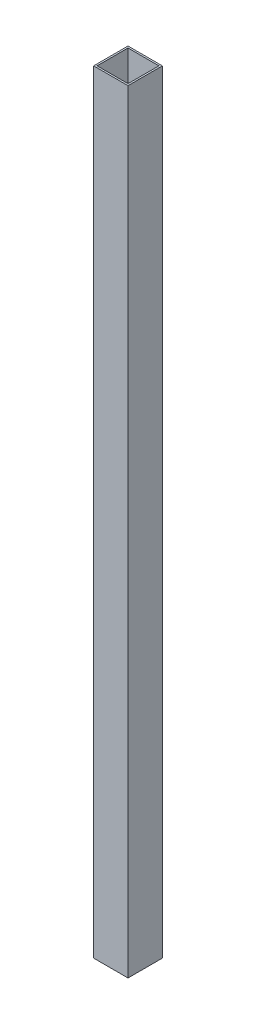
ISO-10303-21;
HEADER;
FILE_DESCRIPTION(('STEP AP214'),'2;1');
FILE_NAME('part.step','',(''),(''),'','','');
FILE_SCHEMA(('AUTOMOTIVE_DESIGN { 1 0 10303 214 1 1 1 1 }'));
ENDSEC;
DATA;
#1=APPLICATION_CONTEXT('core data for automotive mechanical design processes');
#2=APPLICATION_PROTOCOL_DEFINITION('international standard','automotive_design',2000,#1);
#3=PRODUCT_CONTEXT('',#1,'mechanical');
#4=PRODUCT('Part','Part','',(#3));
#5=PRODUCT_RELATED_PRODUCT_CATEGORY('part','',(#4));
#6=PRODUCT_DEFINITION_FORMATION('','',#4);
#7=PRODUCT_DEFINITION_CONTEXT('part definition',#1,'design');
#8=PRODUCT_DEFINITION('design','',#6,#7);
#9=PRODUCT_DEFINITION_SHAPE('','',#8);
#10=(LENGTH_UNIT() NAMED_UNIT(*) SI_UNIT(.MILLI.,.METRE.));
#11=(NAMED_UNIT(*) PLANE_ANGLE_UNIT() SI_UNIT($,.RADIAN.));
#12=(NAMED_UNIT(*) SI_UNIT($,.STERADIAN.) SOLID_ANGLE_UNIT());
#13=UNCERTAINTY_MEASURE_WITH_UNIT(LENGTH_MEASURE(1.E-05),#10,'distance_accuracy_value','');
#14=(GEOMETRIC_REPRESENTATION_CONTEXT(3) GLOBAL_UNCERTAINTY_ASSIGNED_CONTEXT((#13)) GLOBAL_UNIT_ASSIGNED_CONTEXT((#10,
#11,#12)) REPRESENTATION_CONTEXT('',''));
#15=CARTESIAN_POINT('',(0.,0.,0.));
#16=DIRECTION('',(0.,0.,1.));
#17=DIRECTION('',(1.,0.,0.));
#18=AXIS2_PLACEMENT_3D('',#15,#16,#17);
#19=CARTESIAN_POINT('',(20.,900.,20.));
#20=DIRECTION('',(-1.,0.,0.));
#21=DIRECTION('',(0.,0.,1.));
#22=AXIS2_PLACEMENT_3D('',#19,#20,#21);
#23=PLANE('',#22);
#24=DIRECTION('',(0.,0.,-1.));
#25=VECTOR('',#24,1.);
#26=CARTESIAN_POINT('',(20.,0.,20.));
#27=LINE('',#26,#25);
#28=CARTESIAN_POINT('',(20.,0.,20.));
#29=VERTEX_POINT('',#28);
#30=CARTESIAN_POINT('',(20.,0.,-20.));
#31=VERTEX_POINT('',#30);
#32=EDGE_CURVE('E129',#29,#31,#27,.T.);
#33=ORIENTED_EDGE('',*,*,#32,.T.);
#34=DIRECTION('',(0.,-1.,0.));
#35=VECTOR('',#34,1.);
#36=CARTESIAN_POINT('',(20.,900.,-20.));
#37=LINE('',#36,#35);
#38=CARTESIAN_POINT('',(20.,900.,-20.));
#39=VERTEX_POINT('',#38);
#40=EDGE_CURVE('E11',#39,#31,#37,.T.);
#41=ORIENTED_EDGE('',*,*,#40,.F.);
#42=DIRECTION('',(0.,0.,-1.));
#43=VECTOR('',#42,1.);
#44=CARTESIAN_POINT('',(20.,900.,20.));
#45=LINE('',#44,#43);
#46=CARTESIAN_POINT('',(20.,900.,20.));
#47=VERTEX_POINT('',#46);
#48=EDGE_CURVE('E133',#47,#39,#45,.T.);
#49=ORIENTED_EDGE('',*,*,#48,.F.);
#50=DIRECTION('',(0.,-1.,0.));
#51=VECTOR('',#50,1.);
#52=CARTESIAN_POINT('',(20.,900.,20.));
#53=LINE('',#52,#51);
#54=EDGE_CURVE('E143',#47,#29,#53,.T.);
#55=ORIENTED_EDGE('',*,*,#54,.T.);
#56=EDGE_LOOP('',(#33,#41,#49,#55));
#57=FACE_BOUND('',#56,.T.);
#58=ADVANCED_FACE('F32',(#57),#23,.F.);
#59=CARTESIAN_POINT('',(-20.,900.,-20.));
#60=DIRECTION('',(0.,0.,1.));
#61=DIRECTION('',(1.,0.,0.));
#62=AXIS2_PLACEMENT_3D('',#59,#60,#61);
#63=PLANE('',#62);
#64=DIRECTION('',(-1.,0.,0.));
#65=VECTOR('',#64,1.);
#66=CARTESIAN_POINT('',(-20.,0.,-20.));
#67=LINE('',#66,#65);
#68=CARTESIAN_POINT('',(-20.,0.,-20.));
#69=VERTEX_POINT('',#68);
#70=EDGE_CURVE('E146',#31,#69,#67,.T.);
#71=ORIENTED_EDGE('',*,*,#70,.T.);
#72=DIRECTION('',(0.,-1.,0.));
#73=VECTOR('',#72,1.);
#74=CARTESIAN_POINT('',(-20.,900.,-20.));
#75=LINE('',#74,#73);
#76=CARTESIAN_POINT('',(-20.,900.,-20.));
#77=VERTEX_POINT('',#76);
#78=EDGE_CURVE('E39',#77,#69,#75,.T.);
#79=ORIENTED_EDGE('',*,*,#78,.F.);
#80=DIRECTION('',(-1.,0.,0.));
#81=VECTOR('',#80,1.);
#82=CARTESIAN_POINT('',(-20.,900.,-20.));
#83=LINE('',#82,#81);
#84=EDGE_CURVE('E136',#39,#77,#83,.T.);
#85=ORIENTED_EDGE('',*,*,#84,.F.);
#86=ORIENTED_EDGE('',*,*,#40,.T.);
#87=EDGE_LOOP('',(#71,#79,#85,#86));
#88=FACE_BOUND('',#87,.T.);
#89=ADVANCED_FACE('F174',(#88),#63,.F.);
#90=CARTESIAN_POINT('',(-20.,900.,20.));
#91=DIRECTION('',(1.,0.,0.));
#92=DIRECTION('',(0.,0.,-1.));
#93=AXIS2_PLACEMENT_3D('',#90,#91,#92);
#94=PLANE('',#93);
#95=DIRECTION('',(0.,0.,1.));
#96=VECTOR('',#95,1.);
#97=CARTESIAN_POINT('',(-20.,0.,20.));
#98=LINE('',#97,#96);
#99=CARTESIAN_POINT('',(-20.,0.,20.));
#100=VERTEX_POINT('',#99);
#101=EDGE_CURVE('E148',#69,#100,#98,.T.);
#102=ORIENTED_EDGE('',*,*,#101,.T.);
#103=DIRECTION('',(0.,-1.,0.));
#104=VECTOR('',#103,1.);
#105=CARTESIAN_POINT('',(-20.,900.,20.));
#106=LINE('',#105,#104);
#107=CARTESIAN_POINT('',(-20.,900.,20.));
#108=VERTEX_POINT('',#107);
#109=EDGE_CURVE('E153',#108,#100,#106,.T.);
#110=ORIENTED_EDGE('',*,*,#109,.F.);
#111=DIRECTION('',(0.,0.,1.));
#112=VECTOR('',#111,1.);
#113=CARTESIAN_POINT('',(-20.,900.,20.));
#114=LINE('',#113,#112);
#115=EDGE_CURVE('E139',#77,#108,#114,.T.);
#116=ORIENTED_EDGE('',*,*,#115,.F.);
#117=ORIENTED_EDGE('',*,*,#78,.T.);
#118=EDGE_LOOP('',(#102,#110,#116,#117));
#119=FACE_BOUND('',#118,.T.);
#120=ADVANCED_FACE('F160',(#119),#94,.F.);
#121=CARTESIAN_POINT('',(-20.,900.,20.));
#122=DIRECTION('',(0.,0.,-1.));
#123=DIRECTION('',(-1.,0.,0.));
#124=AXIS2_PLACEMENT_3D('',#121,#122,#123);
#125=PLANE('',#124);
#126=DIRECTION('',(1.,0.,0.));
#127=VECTOR('',#126,1.);
#128=CARTESIAN_POINT('',(-20.,0.,20.));
#129=LINE('',#128,#127);
#130=EDGE_CURVE('E137',#100,#29,#129,.T.);
#131=ORIENTED_EDGE('',*,*,#130,.T.);
#132=ORIENTED_EDGE('',*,*,#54,.F.);
#133=DIRECTION('',(1.,0.,0.));
#134=VECTOR('',#133,1.);
#135=CARTESIAN_POINT('',(-20.,900.,20.));
#136=LINE('',#135,#134);
#137=EDGE_CURVE('E141',#108,#47,#136,.T.);
#138=ORIENTED_EDGE('',*,*,#137,.F.);
#139=ORIENTED_EDGE('',*,*,#109,.T.);
#140=EDGE_LOOP('',(#131,#132,#138,#139));
#141=FACE_BOUND('',#140,.T.);
#142=ADVANCED_FACE('F167',(#141),#125,.F.);
#143=CARTESIAN_POINT('',(0.,900.,0.));
#144=DIRECTION('',(0.,-1.,0.));
#145=DIRECTION('',(0.,0.,-1.));
#146=AXIS2_PLACEMENT_3D('',#143,#144,#145);
#147=PLANE('',#146);
#148=DIRECTION('',(0.,0.,-1.));
#149=VECTOR('',#148,1.);
#150=CARTESIAN_POINT('',(18.,900.,18.));
#151=LINE('',#150,#149);
#152=CARTESIAN_POINT('',(18.,900.,18.));
#153=VERTEX_POINT('',#152);
#154=CARTESIAN_POINT('',(18.,900.,-18.));
#155=VERTEX_POINT('',#154);
#156=EDGE_CURVE('E123',#153,#155,#151,.T.);
#157=ORIENTED_EDGE('',*,*,#156,.F.);
#158=DIRECTION('',(1.,0.,0.));
#159=VECTOR('',#158,1.);
#160=CARTESIAN_POINT('',(-18.,900.,18.));
#161=LINE('',#160,#159);
#162=CARTESIAN_POINT('',(-18.,900.,18.));
#163=VERTEX_POINT('',#162);
#164=EDGE_CURVE('E46',#163,#153,#161,.T.);
#165=ORIENTED_EDGE('',*,*,#164,.F.);
#166=DIRECTION('',(0.,0.,1.));
#167=VECTOR('',#166,1.);
#168=CARTESIAN_POINT('',(-18.,900.,-18.));
#169=LINE('',#168,#167);
#170=CARTESIAN_POINT('',(-18.,900.,-18.));
#171=VERTEX_POINT('',#170);
#172=EDGE_CURVE('E114',#171,#163,#169,.T.);
#173=ORIENTED_EDGE('',*,*,#172,.F.);
#174=DIRECTION('',(-1.,0.,0.));
#175=VECTOR('',#174,1.);
#176=CARTESIAN_POINT('',(18.,900.,-18.));
#177=LINE('',#176,#175);
#178=EDGE_CURVE('E117',#155,#171,#177,.T.);
#179=ORIENTED_EDGE('',*,*,#178,.F.);
#180=EDGE_LOOP('',(#157,#165,#173,#179));
#181=FACE_BOUND('',#180,.T.);
#182=ORIENTED_EDGE('',*,*,#48,.T.);
#183=ORIENTED_EDGE('',*,*,#84,.T.);
#184=ORIENTED_EDGE('',*,*,#115,.T.);
#185=ORIENTED_EDGE('',*,*,#137,.T.);
#186=EDGE_LOOP('',(#182,#183,#184,#185));
#187=FACE_BOUND('',#186,.T.);
#188=ADVANCED_FACE('F173',(#181,#187),#147,.F.);
#189=CARTESIAN_POINT('',(0.,0.,0.));
#190=DIRECTION('',(0.,-1.,0.));
#191=DIRECTION('',(0.,0.,-1.));
#192=AXIS2_PLACEMENT_3D('',#189,#190,#191);
#193=PLANE('',#192);
#194=DIRECTION('',(1.,0.,0.));
#195=VECTOR('',#194,1.);
#196=CARTESIAN_POINT('',(-18.,0.,18.));
#197=LINE('',#196,#195);
#198=CARTESIAN_POINT('',(-18.,0.,18.));
#199=VERTEX_POINT('',#198);
#200=CARTESIAN_POINT('',(18.,0.,18.));
#201=VERTEX_POINT('',#200);
#202=EDGE_CURVE('E98',#199,#201,#197,.T.);
#203=ORIENTED_EDGE('',*,*,#202,.T.);
#204=DIRECTION('',(0.,0.,-1.));
#205=VECTOR('',#204,1.);
#206=CARTESIAN_POINT('',(18.,0.,18.));
#207=LINE('',#206,#205);
#208=CARTESIAN_POINT('',(18.,0.,-18.));
#209=VERTEX_POINT('',#208);
#210=EDGE_CURVE('E107',#201,#209,#207,.T.);
#211=ORIENTED_EDGE('',*,*,#210,.T.);
#212=DIRECTION('',(-1.,0.,0.));
#213=VECTOR('',#212,1.);
#214=CARTESIAN_POINT('',(18.,0.,-18.));
#215=LINE('',#214,#213);
#216=CARTESIAN_POINT('',(-18.,0.,-18.));
#217=VERTEX_POINT('',#216);
#218=EDGE_CURVE('E54',#209,#217,#215,.T.);
#219=ORIENTED_EDGE('',*,*,#218,.T.);
#220=DIRECTION('',(0.,0.,1.));
#221=VECTOR('',#220,1.);
#222=CARTESIAN_POINT('',(-18.,0.,-18.));
#223=LINE('',#222,#221);
#224=EDGE_CURVE('E104',#217,#199,#223,.T.);
#225=ORIENTED_EDGE('',*,*,#224,.T.);
#226=EDGE_LOOP('',(#203,#211,#219,#225));
#227=FACE_BOUND('',#226,.T.);
#228=ORIENTED_EDGE('',*,*,#32,.F.);
#229=ORIENTED_EDGE('',*,*,#130,.F.);
#230=ORIENTED_EDGE('',*,*,#101,.F.);
#231=ORIENTED_EDGE('',*,*,#70,.F.);
#232=EDGE_LOOP('',(#228,#229,#230,#231));
#233=FACE_BOUND('',#232,.T.);
#234=ADVANCED_FACE('F111',(#227,#233),#193,.T.);
#235=CARTESIAN_POINT('',(-18.,0.,18.));
#236=DIRECTION('',(0.,0.,1.));
#237=DIRECTION('',(1.,0.,0.));
#238=AXIS2_PLACEMENT_3D('',#235,#236,#237);
#239=PLANE('',#238);
#240=ORIENTED_EDGE('',*,*,#164,.T.);
#241=DIRECTION('',(0.,1.,0.));
#242=VECTOR('',#241,1.);
#243=CARTESIAN_POINT('',(18.,0.,18.));
#244=LINE('',#243,#242);
#245=EDGE_CURVE('E94',#201,#153,#244,.T.);
#246=ORIENTED_EDGE('',*,*,#245,.F.);
#247=ORIENTED_EDGE('',*,*,#202,.F.);
#248=DIRECTION('',(0.,1.,0.));
#249=VECTOR('',#248,1.);
#250=CARTESIAN_POINT('',(-18.,0.,18.));
#251=LINE('',#250,#249);
#252=EDGE_CURVE('E127',#199,#163,#251,.T.);
#253=ORIENTED_EDGE('',*,*,#252,.T.);
#254=EDGE_LOOP('',(#240,#246,#247,#253));
#255=FACE_BOUND('',#254,.T.);
#256=ADVANCED_FACE('F96',(#255),#239,.F.);
#257=CARTESIAN_POINT('',(-18.,0.,-18.));
#258=DIRECTION('',(-1.,0.,0.));
#259=DIRECTION('',(0.,0.,1.));
#260=AXIS2_PLACEMENT_3D('',#257,#258,#259);
#261=PLANE('',#260);
#262=ORIENTED_EDGE('',*,*,#172,.T.);
#263=ORIENTED_EDGE('',*,*,#252,.F.);
#264=ORIENTED_EDGE('',*,*,#224,.F.);
#265=DIRECTION('',(0.,1.,0.));
#266=VECTOR('',#265,1.);
#267=CARTESIAN_POINT('',(-18.,0.,-18.));
#268=LINE('',#267,#266);
#269=EDGE_CURVE('E130',#217,#171,#268,.T.);
#270=ORIENTED_EDGE('',*,*,#269,.T.);
#271=EDGE_LOOP('',(#262,#263,#264,#270));
#272=FACE_BOUND('',#271,.T.);
#273=ADVANCED_FACE('F191',(#272),#261,.F.);
#274=CARTESIAN_POINT('',(18.,0.,-18.));
#275=DIRECTION('',(0.,0.,-1.));
#276=DIRECTION('',(-1.,0.,0.));
#277=AXIS2_PLACEMENT_3D('',#274,#275,#276);
#278=PLANE('',#277);
#279=ORIENTED_EDGE('',*,*,#178,.T.);
#280=ORIENTED_EDGE('',*,*,#269,.F.);
#281=ORIENTED_EDGE('',*,*,#218,.F.);
#282=DIRECTION('',(0.,1.,0.));
#283=VECTOR('',#282,1.);
#284=CARTESIAN_POINT('',(18.,0.,-18.));
#285=LINE('',#284,#283);
#286=EDGE_CURVE('E103',#209,#155,#285,.T.);
#287=ORIENTED_EDGE('',*,*,#286,.T.);
#288=EDGE_LOOP('',(#279,#280,#281,#287));
#289=FACE_BOUND('',#288,.T.);
#290=ADVANCED_FACE('F194',(#289),#278,.F.);
#291=CARTESIAN_POINT('',(18.,0.,18.));
#292=DIRECTION('',(1.,0.,0.));
#293=DIRECTION('',(0.,0.,-1.));
#294=AXIS2_PLACEMENT_3D('',#291,#292,#293);
#295=PLANE('',#294);
#296=ORIENTED_EDGE('',*,*,#156,.T.);
#297=ORIENTED_EDGE('',*,*,#286,.F.);
#298=ORIENTED_EDGE('',*,*,#210,.F.);
#299=ORIENTED_EDGE('',*,*,#245,.T.);
#300=EDGE_LOOP('',(#296,#297,#298,#299));
#301=FACE_BOUND('',#300,.T.);
#302=ADVANCED_FACE('F108',(#301),#295,.F.);
#303=CLOSED_SHELL('',(#58,#89,#120,#142,#188,#234,#256,#273,#290,#302));
#304=MANIFOLD_SOLID_BREP('B2',#303);
#305=ADVANCED_BREP_SHAPE_REPRESENTATION('',(#18,#304),#14);
#306=SHAPE_DEFINITION_REPRESENTATION(#9,#305);
ENDSEC;
END-ISO-10303-21;
